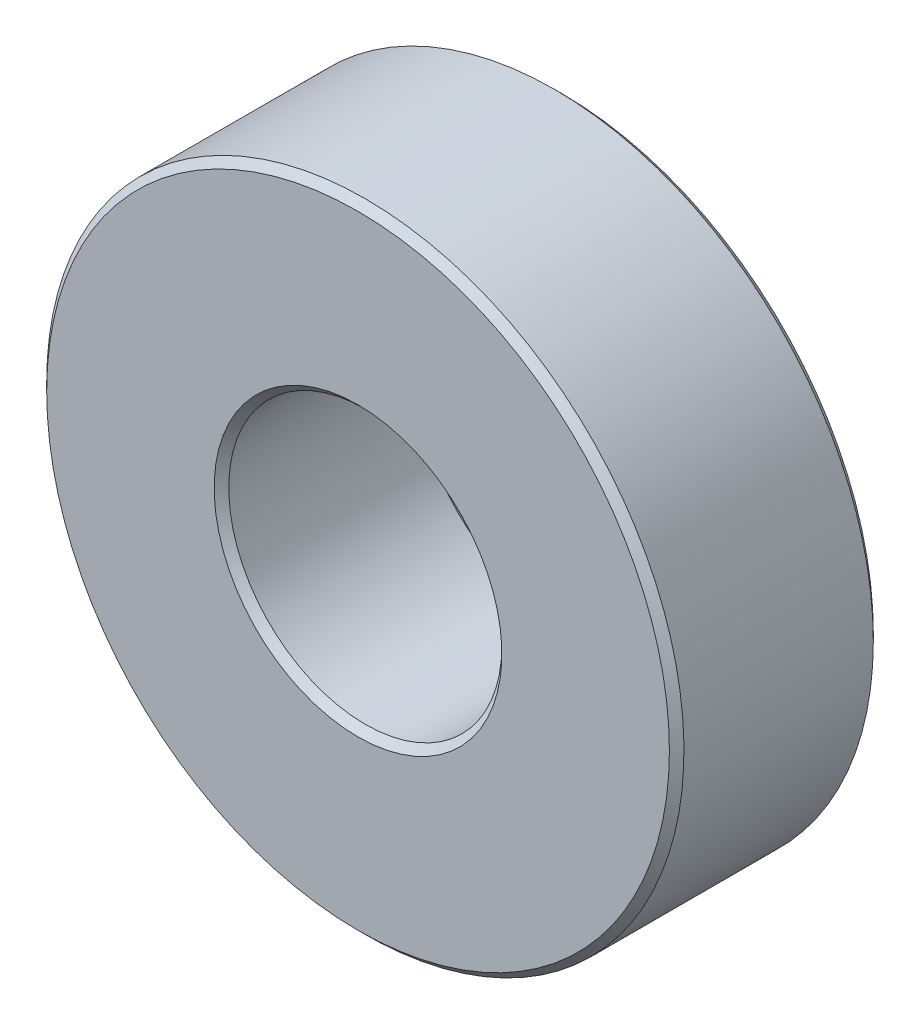
ISO-10303-21;
HEADER;
FILE_DESCRIPTION(('STEP AP214'),'2;1');
FILE_NAME('part.step','',(''),(''),'','','');
FILE_SCHEMA(('AUTOMOTIVE_DESIGN { 1 0 10303 214 1 1 1 1 }'));
ENDSEC;
DATA;
#1=APPLICATION_CONTEXT('core data for automotive mechanical design processes');
#2=APPLICATION_PROTOCOL_DEFINITION('international standard','automotive_design',2000,#1);
#3=PRODUCT_CONTEXT('',#1,'mechanical');
#4=PRODUCT('Part','Part','',(#3));
#5=PRODUCT_RELATED_PRODUCT_CATEGORY('part','',(#4));
#6=PRODUCT_DEFINITION_FORMATION('','',#4);
#7=PRODUCT_DEFINITION_CONTEXT('part definition',#1,'design');
#8=PRODUCT_DEFINITION('design','',#6,#7);
#9=PRODUCT_DEFINITION_SHAPE('','',#8);
#10=(LENGTH_UNIT() NAMED_UNIT(*) SI_UNIT(.MILLI.,.METRE.));
#11=(NAMED_UNIT(*) PLANE_ANGLE_UNIT() SI_UNIT($,.RADIAN.));
#12=(NAMED_UNIT(*) SI_UNIT($,.STERADIAN.) SOLID_ANGLE_UNIT());
#13=UNCERTAINTY_MEASURE_WITH_UNIT(LENGTH_MEASURE(1.E-05),#10,'distance_accuracy_value','');
#14=(GEOMETRIC_REPRESENTATION_CONTEXT(3) GLOBAL_UNCERTAINTY_ASSIGNED_CONTEXT((#13)) GLOBAL_UNIT_ASSIGNED_CONTEXT((#10,
#11,#12)) REPRESENTATION_CONTEXT('',''));
#15=CARTESIAN_POINT('',(0.,0.,0.));
#16=DIRECTION('',(0.,0.,1.));
#17=DIRECTION('',(1.,0.,0.));
#18=AXIS2_PLACEMENT_3D('',#15,#16,#17);
#19=CARTESIAN_POINT('',(0.,0.,0.));
#20=DIRECTION('',(0.,0.,-1.));
#21=DIRECTION('',(0.,1.,0.));
#22=AXIS2_PLACEMENT_3D('',#19,#20,#21);
#23=PLANE('',#22);
#24=CARTESIAN_POINT('',(0.,0.,-5.6843418860808E-11));
#25=DIRECTION('',(0.,0.,-1.));
#26=DIRECTION('',(0.,1.,0.));
#27=AXIS2_PLACEMENT_3D('',#24,#25,#26);
#28=CIRCLE('',#27,5.01650000001064);
#29=CARTESIAN_POINT('',(0.,5.01650000001064,-5.6843418860808E-11));
#30=VERTEX_POINT('',#29);
#31=EDGE_CURVE('E36',#30,#30,#28,.F.);
#32=ORIENTED_EDGE('',*,*,#31,.T.);
#33=EDGE_LOOP('',(#32));
#34=FACE_BOUND('',#33,.T.);
#35=CARTESIAN_POINT('',(0.,0.,0.));
#36=DIRECTION('',(0.,0.,1.));
#37=DIRECTION('',(1.,0.,0.));
#38=AXIS2_PLACEMENT_3D('',#35,#36,#37);
#39=CIRCLE('',#38,10.8585);
#40=CARTESIAN_POINT('',(10.8585,0.,0.));
#41=VERTEX_POINT('',#40);
#42=EDGE_CURVE('E17',#41,#41,#39,.T.);
#43=ORIENTED_EDGE('',*,*,#42,.F.);
#44=EDGE_LOOP('',(#43));
#45=FACE_BOUND('',#44,.T.);
#46=ADVANCED_FACE('F14',(#34,#45),#23,.T.);
#47=CARTESIAN_POINT('',(0.,0.,0.253999999999989));
#48=DIRECTION('',(0.,0.,1.));
#49=DIRECTION('',(1.,0.,0.));
#50=AXIS2_PLACEMENT_3D('',#47,#48,#49);
#51=CONICAL_SURFACE('',#50,11.1125,0.785398163397451);
#52=ORIENTED_EDGE('',*,*,#42,.T.);
#53=EDGE_LOOP('',(#52));
#54=FACE_BOUND('',#53,.T.);
#55=CARTESIAN_POINT('',(0.,0.,0.253999999999976));
#56=DIRECTION('',(0.,0.,-1.));
#57=DIRECTION('',(0.,1.,0.));
#58=AXIS2_PLACEMENT_3D('',#55,#56,#57);
#59=CIRCLE('',#58,11.1125);
#60=CARTESIAN_POINT('',(0.,11.1125,0.253999999999976));
#61=VERTEX_POINT('',#60);
#62=EDGE_CURVE('E34',#61,#61,#59,.F.);
#63=ORIENTED_EDGE('',*,*,#62,.F.);
#64=EDGE_LOOP('',(#63));
#65=FACE_BOUND('',#64,.T.);
#66=ADVANCED_FACE('F49',(#54,#65),#51,.T.);
#67=CARTESIAN_POINT('',(0.,0.,-5.6843418860808E-11));
#68=DIRECTION('',(0.,0.,-1.));
#69=DIRECTION('',(0.,1.,0.));
#70=AXIS2_PLACEMENT_3D('',#67,#68,#69);
#71=CONICAL_SURFACE('',#70,5.01650000001064,0.785398163285552);
#72=ORIENTED_EDGE('',*,*,#31,.F.);
#73=EDGE_LOOP('',(#72));
#74=FACE_BOUND('',#73,.T.);
#75=CARTESIAN_POINT('',(0.,0.,0.253999999999976));
#76=DIRECTION('',(0.,0.,-1.));
#77=DIRECTION('',(0.,1.,0.));
#78=AXIS2_PLACEMENT_3D('',#75,#76,#77);
#79=CIRCLE('',#78,4.7625);
#80=CARTESIAN_POINT('',(0.,4.7625,0.253999999999976));
#81=VERTEX_POINT('',#80);
#82=EDGE_CURVE('E44',#81,#81,#79,.F.);
#83=ORIENTED_EDGE('',*,*,#82,.T.);
#84=EDGE_LOOP('',(#83));
#85=FACE_BOUND('',#84,.T.);
#86=ADVANCED_FACE('F57',(#74,#85),#71,.F.);
#87=CARTESIAN_POINT('',(0.,0.,7.11200000000001));
#88=DIRECTION('',(0.,0.,-1.));
#89=DIRECTION('',(0.,1.,0.));
#90=AXIS2_PLACEMENT_3D('',#87,#88,#89);
#91=CYLINDRICAL_SURFACE('',#90,11.1125);
#92=CARTESIAN_POINT('',(0.,0.,6.85799999999998));
#93=DIRECTION('',(0.,0.,-1.));
#94=DIRECTION('',(-1.,0.,0.));
#95=AXIS2_PLACEMENT_3D('',#92,#93,#94);
#96=CIRCLE('',#95,11.1125);
#97=CARTESIAN_POINT('',(-11.1125,0.,6.85799999999997));
#98=VERTEX_POINT('',#97);
#99=EDGE_CURVE('E88',#98,#98,#96,.F.);
#100=ORIENTED_EDGE('',*,*,#99,.F.);
#101=EDGE_LOOP('',(#100));
#102=FACE_BOUND('',#101,.T.);
#103=ORIENTED_EDGE('',*,*,#62,.T.);
#104=EDGE_LOOP('',(#103));
#105=FACE_BOUND('',#104,.T.);
#106=ADVANCED_FACE('F76',(#102,#105),#91,.T.);
#107=CARTESIAN_POINT('',(0.,0.,7.11200000000001));
#108=DIRECTION('',(0.,0.,-1.));
#109=DIRECTION('',(0.,1.,0.));
#110=AXIS2_PLACEMENT_3D('',#107,#108,#109);
#111=CYLINDRICAL_SURFACE('',#110,4.7625);
#112=ORIENTED_EDGE('',*,*,#82,.F.);
#113=EDGE_LOOP('',(#112));
#114=FACE_BOUND('',#113,.T.);
#115=CARTESIAN_POINT('',(0.,0.,6.85800000002246));
#116=DIRECTION('',(0.,0.,1.));
#117=DIRECTION('',(1.,0.,0.));
#118=AXIS2_PLACEMENT_3D('',#115,#116,#117);
#119=CIRCLE('',#118,4.76250000002665);
#120=CARTESIAN_POINT('',(4.76250000002665,0.,6.85800000002246));
#121=VERTEX_POINT('',#120);
#122=EDGE_CURVE('E31',#121,#121,#119,.T.);
#123=ORIENTED_EDGE('',*,*,#122,.T.);
#124=EDGE_LOOP('',(#123));
#125=FACE_BOUND('',#124,.T.);
#126=ADVANCED_FACE('F72',(#114,#125),#111,.F.);
#127=CARTESIAN_POINT('',(0.,0.,6.85799999999997));
#128=DIRECTION('',(0.,0.,-1.));
#129=DIRECTION('',(0.,1.,0.));
#130=AXIS2_PLACEMENT_3D('',#127,#128,#129);
#131=CONICAL_SURFACE('',#130,11.1125,0.78539816339745);
#132=CARTESIAN_POINT('',(0.,0.,7.11199999999999));
#133=DIRECTION('',(0.,0.,-1.));
#134=DIRECTION('',(0.,1.,0.));
#135=AXIS2_PLACEMENT_3D('',#132,#133,#134);
#136=CIRCLE('',#135,10.8585);
#137=CARTESIAN_POINT('',(0.,10.8585,7.11199999999999));
#138=VERTEX_POINT('',#137);
#139=EDGE_CURVE('E22',#138,#138,#136,.T.);
#140=ORIENTED_EDGE('',*,*,#139,.T.);
#141=EDGE_LOOP('',(#140));
#142=FACE_BOUND('',#141,.T.);
#143=ORIENTED_EDGE('',*,*,#99,.T.);
#144=EDGE_LOOP('',(#143));
#145=FACE_BOUND('',#144,.T.);
#146=ADVANCED_FACE('F66',(#142,#145),#131,.T.);
#147=CARTESIAN_POINT('',(0.,0.,7.11200000000645));
#148=DIRECTION('',(0.,0.,1.));
#149=DIRECTION('',(0.,-1.,0.));
#150=AXIS2_PLACEMENT_3D('',#147,#148,#149);
#151=CONICAL_SURFACE('',#150,5.01650000001064,0.785398163397448);
#152=CARTESIAN_POINT('',(0.,0.,7.11200000000645));
#153=DIRECTION('',(0.,0.,1.));
#154=DIRECTION('',(0.,-1.,0.));
#155=AXIS2_PLACEMENT_3D('',#152,#153,#154);
#156=CIRCLE('',#155,5.01650000001064);
#157=CARTESIAN_POINT('',(0.,-5.01650000001064,7.11200000000645));
#158=VERTEX_POINT('',#157);
#159=EDGE_CURVE('E10',#158,#158,#156,.T.);
#160=ORIENTED_EDGE('',*,*,#159,.T.);
#161=EDGE_LOOP('',(#160));
#162=FACE_BOUND('',#161,.T.);
#163=ORIENTED_EDGE('',*,*,#122,.F.);
#164=EDGE_LOOP('',(#163));
#165=FACE_BOUND('',#164,.T.);
#166=ADVANCED_FACE('F60',(#162,#165),#151,.F.);
#167=CARTESIAN_POINT('',(0.,0.,7.11200000000001));
#168=DIRECTION('',(0.,0.,-1.));
#169=DIRECTION('',(0.,1.,0.));
#170=AXIS2_PLACEMENT_3D('',#167,#168,#169);
#171=PLANE('',#170);
#172=ORIENTED_EDGE('',*,*,#159,.F.);
#173=EDGE_LOOP('',(#172));
#174=FACE_BOUND('',#173,.T.);
#175=ORIENTED_EDGE('',*,*,#139,.F.);
#176=EDGE_LOOP('',(#175));
#177=FACE_BOUND('',#176,.T.);
#178=ADVANCED_FACE('F58',(#174,#177),#171,.F.);
#179=CLOSED_SHELL('',(#46,#66,#86,#106,#126,#146,#166,#178));
#180=MANIFOLD_SOLID_BREP('B1',#179);
#181=ADVANCED_BREP_SHAPE_REPRESENTATION('',(#18,#180),#14);
#182=SHAPE_DEFINITION_REPRESENTATION(#9,#181);
ENDSEC;
END-ISO-10303-21;
